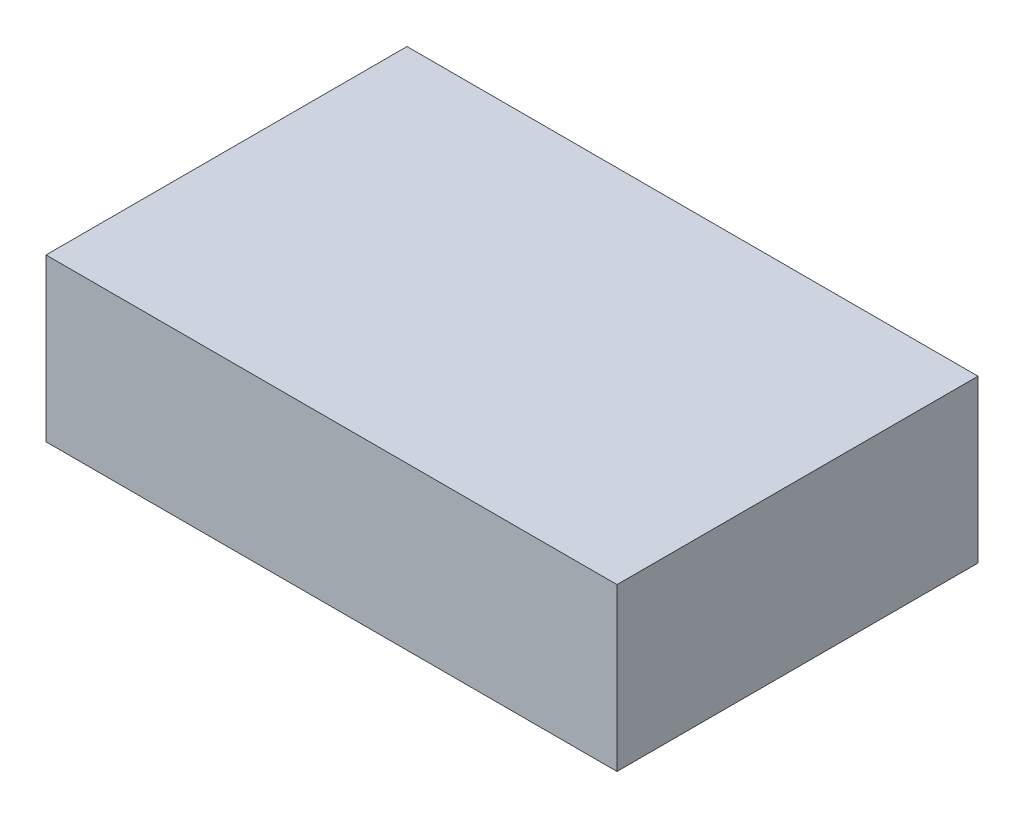
ISO-10303-21;
HEADER;
FILE_DESCRIPTION(('STEP AP214'),'2;1');
FILE_NAME('part.step','',(''),(''),'','','');
FILE_SCHEMA(('AUTOMOTIVE_DESIGN { 1 0 10303 214 1 1 1 1 }'));
ENDSEC;
DATA;
#1=APPLICATION_CONTEXT('core data for automotive mechanical design processes');
#2=APPLICATION_PROTOCOL_DEFINITION('international standard','automotive_design',2000,#1);
#3=PRODUCT_CONTEXT('',#1,'mechanical');
#4=PRODUCT('Part','Part','',(#3));
#5=PRODUCT_RELATED_PRODUCT_CATEGORY('part','',(#4));
#6=PRODUCT_DEFINITION_FORMATION('','',#4);
#7=PRODUCT_DEFINITION_CONTEXT('part definition',#1,'design');
#8=PRODUCT_DEFINITION('design','',#6,#7);
#9=PRODUCT_DEFINITION_SHAPE('','',#8);
#10=(LENGTH_UNIT() NAMED_UNIT(*) SI_UNIT(.MILLI.,.METRE.));
#11=(NAMED_UNIT(*) PLANE_ANGLE_UNIT() SI_UNIT($,.RADIAN.));
#12=(NAMED_UNIT(*) SI_UNIT($,.STERADIAN.) SOLID_ANGLE_UNIT());
#13=UNCERTAINTY_MEASURE_WITH_UNIT(LENGTH_MEASURE(1.E-05),#10,'distance_accuracy_value','');
#14=(GEOMETRIC_REPRESENTATION_CONTEXT(3) GLOBAL_UNCERTAINTY_ASSIGNED_CONTEXT((#13)) GLOBAL_UNIT_ASSIGNED_CONTEXT((#10,
#11,#12)) REPRESENTATION_CONTEXT('',''));
#15=CARTESIAN_POINT('',(0.,0.,0.));
#16=DIRECTION('',(0.,0.,1.));
#17=DIRECTION('',(1.,0.,0.));
#18=AXIS2_PLACEMENT_3D('',#15,#16,#17);
#19=CARTESIAN_POINT('',(-0.47448978,0.13449046,0.));
#20=DIRECTION('',(-2.67655206245712E-06,0.999999999996418,0.));
#21=DIRECTION('',(0.999999999996418,2.67655206245712E-06,0.));
#22=AXIS2_PLACEMENT_3D('',#19,#20,#21);
#23=PLANE('',#22);
#24=DIRECTION('',(0.,0.,1.));
#25=VECTOR('',#24,1.);
#26=CARTESIAN_POINT('',(-0.47448978,0.13449046,0.));
#27=LINE('',#26,#25);
#28=CARTESIAN_POINT('',(-0.47448978,0.13449046,0.));
#29=VERTEX_POINT('',#28);
#30=CARTESIAN_POINT('',(-0.47448978,0.13449046,0.5999988));
#31=VERTEX_POINT('',#30);
#32=EDGE_CURVE('E10',#29,#31,#27,.T.);
#33=ORIENTED_EDGE('',*,*,#32,.T.);
#34=DIRECTION('',(0.999999999996418,2.67655206245712E-06,0.));
#35=VECTOR('',#34,1.);
#36=CARTESIAN_POINT('',(-0.47448978,0.13449046,0.5999988));
#37=LINE('',#36,#35);
#38=CARTESIAN_POINT('',(0.47449232,0.134493,0.5999988));
#39=VERTEX_POINT('',#38);
#40=EDGE_CURVE('E22',#31,#39,#37,.T.);
#41=ORIENTED_EDGE('',*,*,#40,.T.);
#42=DIRECTION('',(0.,0.,1.));
#43=VECTOR('',#42,1.);
#44=CARTESIAN_POINT('',(0.47449232,0.134493,0.));
#45=LINE('',#44,#43);
#46=CARTESIAN_POINT('',(0.47449232,0.134493,0.));
#47=VERTEX_POINT('',#46);
#48=EDGE_CURVE('E83',#47,#39,#45,.T.);
#49=ORIENTED_EDGE('',*,*,#48,.F.);
#50=DIRECTION('',(0.999999999996418,2.67655206245712E-06,0.));
#51=VECTOR('',#50,1.);
#52=CARTESIAN_POINT('',(-0.47448978,0.13449046,0.));
#53=LINE('',#52,#51);
#54=EDGE_CURVE('E81',#29,#47,#53,.T.);
#55=ORIENTED_EDGE('',*,*,#54,.F.);
#56=EDGE_LOOP('',(#33,#41,#49,#55));
#57=FACE_BOUND('',#56,.T.);
#58=ADVANCED_FACE('F15',(#57),#23,.T.);
#59=CARTESIAN_POINT('',(0.47449232,0.134493,0.));
#60=DIRECTION('',(1.,0.,0.));
#61=DIRECTION('',(0.,-1.,0.));
#62=AXIS2_PLACEMENT_3D('',#59,#60,#61);
#63=PLANE('',#62);
#64=ORIENTED_EDGE('',*,*,#48,.T.);
#65=DIRECTION('',(0.,-1.,0.));
#66=VECTOR('',#65,1.);
#67=CARTESIAN_POINT('',(0.47449232,0.134493,0.5999988));
#68=LINE('',#67,#66);
#69=CARTESIAN_POINT('',(0.47449232,-0.13449046,0.5999988));
#70=VERTEX_POINT('',#69);
#71=EDGE_CURVE('E79',#39,#70,#68,.T.);
#72=ORIENTED_EDGE('',*,*,#71,.T.);
#73=DIRECTION('',(0.,0.,1.));
#74=VECTOR('',#73,1.);
#75=CARTESIAN_POINT('',(0.47449232,-0.13449046,0.));
#76=LINE('',#75,#74);
#77=CARTESIAN_POINT('',(0.47449232,-0.13449046,0.));
#78=VERTEX_POINT('',#77);
#79=EDGE_CURVE('E77',#78,#70,#76,.T.);
#80=ORIENTED_EDGE('',*,*,#79,.F.);
#81=DIRECTION('',(0.,-1.,0.));
#82=VECTOR('',#81,1.);
#83=CARTESIAN_POINT('',(0.47449232,0.134493,0.));
#84=LINE('',#83,#82);
#85=EDGE_CURVE('E68',#47,#78,#84,.T.);
#86=ORIENTED_EDGE('',*,*,#85,.F.);
#87=EDGE_LOOP('',(#64,#72,#80,#86));
#88=FACE_BOUND('',#87,.T.);
#89=ADVANCED_FACE('F88',(#88),#63,.T.);
#90=CARTESIAN_POINT('',(0.47449232,-0.13449046,0.));
#91=DIRECTION('',(0.,-1.,0.));
#92=DIRECTION('',(-1.,0.,0.));
#93=AXIS2_PLACEMENT_3D('',#90,#91,#92);
#94=PLANE('',#93);
#95=ORIENTED_EDGE('',*,*,#79,.T.);
#96=DIRECTION('',(-1.,0.,0.));
#97=VECTOR('',#96,1.);
#98=CARTESIAN_POINT('',(0.47449232,-0.13449046,0.5999988));
#99=LINE('',#98,#97);
#100=CARTESIAN_POINT('',(-0.47448724,-0.13449046,0.5999988));
#101=VERTEX_POINT('',#100);
#102=EDGE_CURVE('E58',#70,#101,#99,.T.);
#103=ORIENTED_EDGE('',*,*,#102,.T.);
#104=DIRECTION('',(0.,0.,1.));
#105=VECTOR('',#104,1.);
#106=CARTESIAN_POINT('',(-0.47448724,-0.13449046,0.));
#107=LINE('',#106,#105);
#108=CARTESIAN_POINT('',(-0.47448724,-0.13449046,0.));
#109=VERTEX_POINT('',#108);
#110=EDGE_CURVE('E52',#109,#101,#107,.T.);
#111=ORIENTED_EDGE('',*,*,#110,.F.);
#112=DIRECTION('',(-1.,0.,0.));
#113=VECTOR('',#112,1.);
#114=CARTESIAN_POINT('',(0.47449232,-0.13449046,0.));
#115=LINE('',#114,#113);
#116=EDGE_CURVE('E56',#78,#109,#115,.T.);
#117=ORIENTED_EDGE('',*,*,#116,.F.);
#118=EDGE_LOOP('',(#95,#103,#111,#117));
#119=FACE_BOUND('',#118,.T.);
#120=ADVANCED_FACE('F55',(#119),#94,.T.);
#121=CARTESIAN_POINT('',(-0.47448724,-0.13449046,0.));
#122=DIRECTION('',(-0.999999999955414,-9.44304896007291E-06,0.));
#123=DIRECTION('',(-9.44304896007291E-06,0.999999999955414,0.));
#124=AXIS2_PLACEMENT_3D('',#121,#122,#123);
#125=PLANE('',#124);
#126=ORIENTED_EDGE('',*,*,#110,.T.);
#127=DIRECTION('',(-9.44304896007291E-06,0.999999999955414,0.));
#128=VECTOR('',#127,1.);
#129=CARTESIAN_POINT('',(-0.47448724,-0.13449046,0.5999988));
#130=LINE('',#129,#128);
#131=EDGE_CURVE('E69',#101,#31,#130,.T.);
#132=ORIENTED_EDGE('',*,*,#131,.T.);
#133=ORIENTED_EDGE('',*,*,#32,.F.);
#134=DIRECTION('',(-9.44304896007291E-06,0.999999999955414,0.));
#135=VECTOR('',#134,1.);
#136=CARTESIAN_POINT('',(-0.47448724,-0.13449046,0.));
#137=LINE('',#136,#135);
#138=EDGE_CURVE('E66',#109,#29,#137,.T.);
#139=ORIENTED_EDGE('',*,*,#138,.F.);
#140=EDGE_LOOP('',(#126,#132,#133,#139));
#141=FACE_BOUND('',#140,.T.);
#142=ADVANCED_FACE('F71',(#141),#125,.T.);
#143=CARTESIAN_POINT('',(-0.47448978,0.13449046,0.));
#144=DIRECTION('',(0.,0.,1.));
#145=DIRECTION('',(1.,0.,0.));
#146=AXIS2_PLACEMENT_3D('',#143,#144,#145);
#147=PLANE('',#146);
#148=ORIENTED_EDGE('',*,*,#54,.T.);
#149=ORIENTED_EDGE('',*,*,#85,.T.);
#150=ORIENTED_EDGE('',*,*,#116,.T.);
#151=ORIENTED_EDGE('',*,*,#138,.T.);
#152=EDGE_LOOP('',(#148,#149,#150,#151));
#153=FACE_BOUND('',#152,.T.);
#154=ADVANCED_FACE('F65',(#153),#147,.F.);
#155=CARTESIAN_POINT('',(-0.47448978,0.13449046,0.5999988));
#156=DIRECTION('',(0.,0.,1.));
#157=DIRECTION('',(1.,0.,0.));
#158=AXIS2_PLACEMENT_3D('',#155,#156,#157);
#159=PLANE('',#158);
#160=ORIENTED_EDGE('',*,*,#131,.F.);
#161=ORIENTED_EDGE('',*,*,#102,.F.);
#162=ORIENTED_EDGE('',*,*,#71,.F.);
#163=ORIENTED_EDGE('',*,*,#40,.F.);
#164=EDGE_LOOP('',(#160,#161,#162,#163));
#165=FACE_BOUND('',#164,.T.);
#166=ADVANCED_FACE('F89',(#165),#159,.T.);
#167=CLOSED_SHELL('',(#58,#89,#120,#142,#154,#166));
#168=MANIFOLD_SOLID_BREP('B1',#167);
#169=ADVANCED_BREP_SHAPE_REPRESENTATION('',(#18,#168),#14);
#170=SHAPE_DEFINITION_REPRESENTATION(#9,#169);
ENDSEC;
END-ISO-10303-21;
